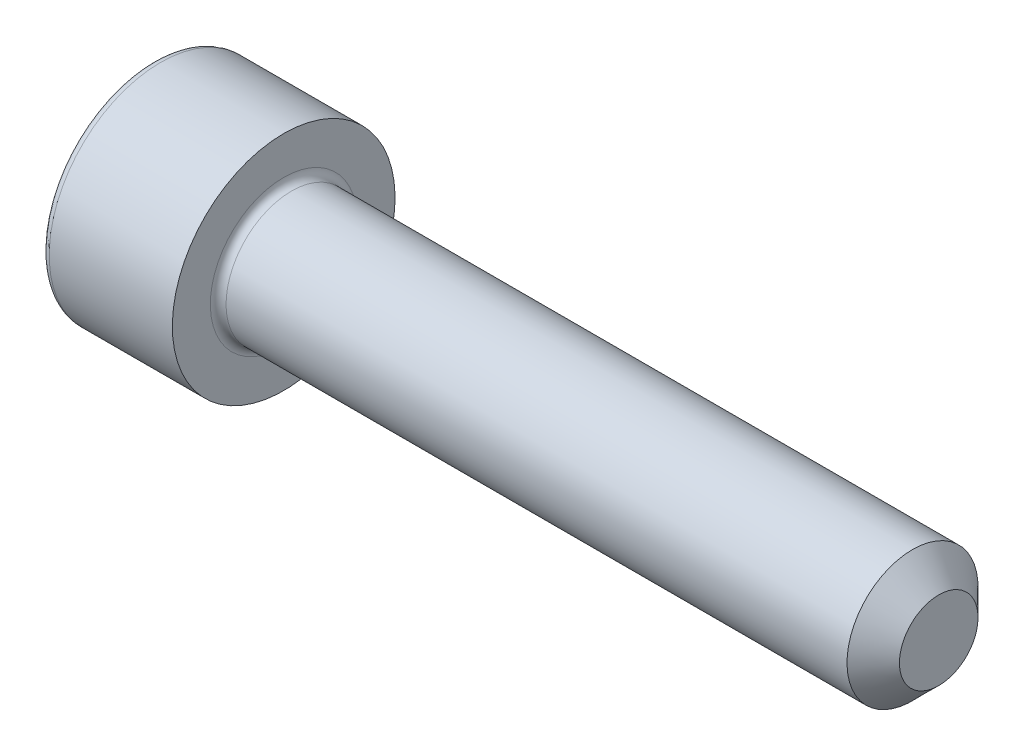
ISO-10303-21;
HEADER;
FILE_DESCRIPTION(('STEP AP214'),'2;1');
FILE_NAME('part.step','',(''),(''),'','','');
FILE_SCHEMA(('AUTOMOTIVE_DESIGN { 1 0 10303 214 1 1 1 1 }'));
ENDSEC;
DATA;
#1=APPLICATION_CONTEXT('core data for automotive mechanical design processes');
#2=APPLICATION_PROTOCOL_DEFINITION('international standard','automotive_design',2000,#1);
#3=PRODUCT_CONTEXT('',#1,'mechanical');
#4=PRODUCT('Part','Part','',(#3));
#5=PRODUCT_RELATED_PRODUCT_CATEGORY('part','',(#4));
#6=PRODUCT_DEFINITION_FORMATION('','',#4);
#7=PRODUCT_DEFINITION_CONTEXT('part definition',#1,'design');
#8=PRODUCT_DEFINITION('design','',#6,#7);
#9=PRODUCT_DEFINITION_SHAPE('','',#8);
#10=(LENGTH_UNIT() NAMED_UNIT(*) SI_UNIT(.MILLI.,.METRE.));
#11=(NAMED_UNIT(*) PLANE_ANGLE_UNIT() SI_UNIT($,.RADIAN.));
#12=(NAMED_UNIT(*) SI_UNIT($,.STERADIAN.) SOLID_ANGLE_UNIT());
#13=UNCERTAINTY_MEASURE_WITH_UNIT(LENGTH_MEASURE(1.E-05),#10,'distance_accuracy_value','');
#14=(GEOMETRIC_REPRESENTATION_CONTEXT(3) GLOBAL_UNCERTAINTY_ASSIGNED_CONTEXT((#13)) GLOBAL_UNIT_ASSIGNED_CONTEXT((#10,
#11,#12)) REPRESENTATION_CONTEXT('',''));
#15=CARTESIAN_POINT('',(0.,0.,0.));
#16=DIRECTION('',(0.,0.,1.));
#17=DIRECTION('',(1.,0.,0.));
#18=AXIS2_PLACEMENT_3D('',#15,#16,#17);
#19=CARTESIAN_POINT('',(0.,0.,0.));
#20=DIRECTION('',(-1.,0.,0.));
#21=DIRECTION('',(0.,-1.,0.));
#22=AXIS2_PLACEMENT_3D('',#19,#20,#21);
#23=PLANE('',#22);
#24=CARTESIAN_POINT('',(0.,0.,0.));
#25=DIRECTION('',(-1.,0.,0.));
#26=DIRECTION('',(0.,-1.,0.));
#27=AXIS2_PLACEMENT_3D('',#24,#25,#26);
#28=CIRCLE('',#27,3.95);
#29=CARTESIAN_POINT('',(0.,-3.95,0.));
#30=VERTEX_POINT('',#29);
#31=EDGE_CURVE('E158',#30,#30,#28,.T.);
#32=ORIENTED_EDGE('',*,*,#31,.T.);
#33=EDGE_LOOP('',(#32));
#34=FACE_BOUND('',#33,.T.);
#35=DIRECTION('',(0.,0.,-1.));
#36=VECTOR('',#35,1.);
#37=CARTESIAN_POINT('',(0.,2.,1.15470053837925));
#38=LINE('',#37,#36);
#39=CARTESIAN_POINT('',(0.,2.,1.15470053837925));
#40=VERTEX_POINT('',#39);
#41=CARTESIAN_POINT('',(0.,2.,-1.15470053837925));
#42=VERTEX_POINT('',#41);
#43=EDGE_CURVE('E54',#40,#42,#38,.T.);
#44=ORIENTED_EDGE('',*,*,#43,.F.);
#45=DIRECTION('',(0.,0.866025403784439,-0.5));
#46=VECTOR('',#45,1.);
#47=CARTESIAN_POINT('',(0.,0.,2.3094010767585));
#48=LINE('',#47,#46);
#49=CARTESIAN_POINT('',(0.,0.,2.3094010767585));
#50=VERTEX_POINT('',#49);
#51=EDGE_CURVE('E137',#50,#40,#48,.T.);
#52=ORIENTED_EDGE('',*,*,#51,.F.);
#53=DIRECTION('',(0.,0.866025403784438,0.5));
#54=VECTOR('',#53,1.);
#55=CARTESIAN_POINT('',(0.,-2.,1.15470053837925));
#56=LINE('',#55,#54);
#57=CARTESIAN_POINT('',(0.,-2.,1.15470053837925));
#58=VERTEX_POINT('',#57);
#59=EDGE_CURVE('E135',#58,#50,#56,.T.);
#60=ORIENTED_EDGE('',*,*,#59,.F.);
#61=DIRECTION('',(0.,0.,1.));
#62=VECTOR('',#61,1.);
#63=CARTESIAN_POINT('',(0.,-2.,-1.15470053837925));
#64=LINE('',#63,#62);
#65=CARTESIAN_POINT('',(0.,-2.,-1.15470053837925));
#66=VERTEX_POINT('',#65);
#67=EDGE_CURVE('E102',#66,#58,#64,.T.);
#68=ORIENTED_EDGE('',*,*,#67,.F.);
#69=DIRECTION('',(0.,-0.866025403784439,0.5));
#70=VECTOR('',#69,1.);
#71=CARTESIAN_POINT('',(0.,0.,-2.3094010767585));
#72=LINE('',#71,#70);
#73=CARTESIAN_POINT('',(0.,0.,-2.3094010767585));
#74=VERTEX_POINT('',#73);
#75=EDGE_CURVE('E131',#74,#66,#72,.T.);
#76=ORIENTED_EDGE('',*,*,#75,.F.);
#77=DIRECTION('',(0.,-0.866025403784439,-0.5));
#78=VECTOR('',#77,1.);
#79=CARTESIAN_POINT('',(0.,2.,-1.15470053837925));
#80=LINE('',#79,#78);
#81=EDGE_CURVE('E128',#42,#74,#80,.T.);
#82=ORIENTED_EDGE('',*,*,#81,.F.);
#83=EDGE_LOOP('',(#44,#52,#60,#68,#76,#82));
#84=FACE_BOUND('',#83,.T.);
#85=ADVANCED_FACE('F38',(#34,#84),#23,.T.);
#86=CARTESIAN_POINT('',(30.,0.,0.));
#87=DIRECTION('',(1.,0.,0.));
#88=DIRECTION('',(0.,1.,0.));
#89=AXIS2_PLACEMENT_3D('',#86,#87,#88);
#90=CYLINDRICAL_SURFACE('',#89,4.25);
#91=CARTESIAN_POINT('',(0.300000000000002,0.,0.));
#92=DIRECTION('',(-1.,0.,0.));
#93=DIRECTION('',(0.,-1.,0.));
#94=AXIS2_PLACEMENT_3D('',#91,#92,#93);
#95=CIRCLE('',#94,4.25);
#96=CARTESIAN_POINT('',(0.300000000000002,-4.25,0.));
#97=VERTEX_POINT('',#96);
#98=EDGE_CURVE('E155',#97,#97,#95,.F.);
#99=ORIENTED_EDGE('',*,*,#98,.T.);
#100=EDGE_LOOP('',(#99));
#101=FACE_BOUND('',#100,.T.);
#102=CARTESIAN_POINT('',(5.,0.,0.));
#103=DIRECTION('',(1.,0.,0.));
#104=DIRECTION('',(0.,1.,0.));
#105=AXIS2_PLACEMENT_3D('',#102,#103,#104);
#106=CIRCLE('',#105,4.25);
#107=CARTESIAN_POINT('',(5.,4.25,0.));
#108=VERTEX_POINT('',#107);
#109=EDGE_CURVE('E141',#108,#108,#106,.T.);
#110=ORIENTED_EDGE('',*,*,#109,.F.);
#111=EDGE_LOOP('',(#110));
#112=FACE_BOUND('',#111,.T.);
#113=ADVANCED_FACE('F175',(#101,#112),#90,.T.);
#114=CARTESIAN_POINT('',(5.,4.25,0.));
#115=DIRECTION('',(1.,0.,0.));
#116=DIRECTION('',(0.,1.,0.));
#117=AXIS2_PLACEMENT_3D('',#114,#115,#116);
#118=PLANE('',#117);
#119=CARTESIAN_POINT('',(5.,0.,0.));
#120=DIRECTION('',(1.,0.,0.));
#121=DIRECTION('',(0.,1.,0.));
#122=AXIS2_PLACEMENT_3D('',#119,#120,#121);
#123=CIRCLE('',#122,2.8);
#124=CARTESIAN_POINT('',(5.,2.8,0.));
#125=VERTEX_POINT('',#124);
#126=EDGE_CURVE('E152',#125,#125,#123,.F.);
#127=ORIENTED_EDGE('',*,*,#126,.T.);
#128=EDGE_LOOP('',(#127));
#129=FACE_BOUND('',#128,.T.);
#130=ORIENTED_EDGE('',*,*,#109,.T.);
#131=EDGE_LOOP('',(#130));
#132=FACE_BOUND('',#131,.T.);
#133=ADVANCED_FACE('F181',(#129,#132),#118,.T.);
#134=CARTESIAN_POINT('',(30.,0.,0.));
#135=DIRECTION('',(1.,0.,0.));
#136=DIRECTION('',(0.,1.,0.));
#137=AXIS2_PLACEMENT_3D('',#134,#135,#136);
#138=CYLINDRICAL_SURFACE('',#137,2.5);
#139=CARTESIAN_POINT('',(29.,0.,0.));
#140=DIRECTION('',(1.,0.,0.));
#141=DIRECTION('',(0.,1.,0.));
#142=AXIS2_PLACEMENT_3D('',#139,#140,#141);
#143=CIRCLE('',#142,2.5);
#144=CARTESIAN_POINT('',(29.,2.5,0.));
#145=VERTEX_POINT('',#144);
#146=EDGE_CURVE('E11',#145,#145,#143,.F.);
#147=ORIENTED_EDGE('',*,*,#146,.T.);
#148=EDGE_LOOP('',(#147));
#149=FACE_BOUND('',#148,.T.);
#150=CARTESIAN_POINT('',(5.3,0.,0.));
#151=DIRECTION('',(1.,0.,0.));
#152=DIRECTION('',(0.,1.,0.));
#153=AXIS2_PLACEMENT_3D('',#150,#151,#152);
#154=CIRCLE('',#153,2.5);
#155=CARTESIAN_POINT('',(5.3,2.5,0.));
#156=VERTEX_POINT('',#155);
#157=EDGE_CURVE('E149',#156,#156,#154,.T.);
#158=ORIENTED_EDGE('',*,*,#157,.T.);
#159=EDGE_LOOP('',(#158));
#160=FACE_BOUND('',#159,.T.);
#161=ADVANCED_FACE('F198',(#149,#160),#138,.T.);
#162=CARTESIAN_POINT('',(30.,2.5,0.));
#163=DIRECTION('',(1.,0.,0.));
#164=DIRECTION('',(0.,1.,0.));
#165=AXIS2_PLACEMENT_3D('',#162,#163,#164);
#166=PLANE('',#165);
#167=CARTESIAN_POINT('',(30.,0.,0.));
#168=DIRECTION('',(1.,0.,0.));
#169=DIRECTION('',(0.,1.,0.));
#170=AXIS2_PLACEMENT_3D('',#167,#168,#169);
#171=CIRCLE('',#170,1.5);
#172=CARTESIAN_POINT('',(30.,1.50000000000001,0.));
#173=VERTEX_POINT('',#172);
#174=EDGE_CURVE('E47',#173,#173,#171,.T.);
#175=ORIENTED_EDGE('',*,*,#174,.T.);
#176=EDGE_LOOP('',(#175));
#177=FACE_BOUND('',#176,.T.);
#178=ADVANCED_FACE('F163',(#177),#166,.T.);
#179=CARTESIAN_POINT('',(2.5,2.,1.15470053837925));
#180=DIRECTION('',(0.,1.,0.));
#181=DIRECTION('',(-1.,0.,0.));
#182=AXIS2_PLACEMENT_3D('',#179,#180,#181);
#183=PLANE('',#182);
#184=ORIENTED_EDGE('',*,*,#43,.T.);
#185=DIRECTION('',(-1.,0.,0.));
#186=VECTOR('',#185,1.);
#187=CARTESIAN_POINT('',(2.5,2.,-1.15470053837925));
#188=LINE('',#187,#186);
#189=CARTESIAN_POINT('',(2.5,2.,-1.15470053837925));
#190=VERTEX_POINT('',#189);
#191=EDGE_CURVE('E84',#190,#42,#188,.T.);
#192=ORIENTED_EDGE('',*,*,#191,.F.);
#193=DIRECTION('',(0.,0.,-1.));
#194=VECTOR('',#193,1.);
#195=CARTESIAN_POINT('',(2.5,2.,1.15470053837925));
#196=LINE('',#195,#194);
#197=CARTESIAN_POINT('',(2.5,2.,1.15470053837925));
#198=VERTEX_POINT('',#197);
#199=EDGE_CURVE('E139',#198,#190,#196,.T.);
#200=ORIENTED_EDGE('',*,*,#199,.F.);
#201=DIRECTION('',(-1.,0.,0.));
#202=VECTOR('',#201,1.);
#203=CARTESIAN_POINT('',(2.5,2.,1.15470053837925));
#204=LINE('',#203,#202);
#205=EDGE_CURVE('E62',#198,#40,#204,.T.);
#206=ORIENTED_EDGE('',*,*,#205,.T.);
#207=EDGE_LOOP('',(#184,#192,#200,#206));
#208=FACE_BOUND('',#207,.T.);
#209=ADVANCED_FACE('F206',(#208),#183,.F.);
#210=CARTESIAN_POINT('',(2.5,0.,2.3094010767585));
#211=DIRECTION('',(0.,0.5,0.866025403784439));
#212=DIRECTION('',(0.,-0.866025403784439,0.5));
#213=AXIS2_PLACEMENT_3D('',#210,#211,#212);
#214=PLANE('',#213);
#215=ORIENTED_EDGE('',*,*,#51,.T.);
#216=ORIENTED_EDGE('',*,*,#205,.F.);
#217=DIRECTION('',(0.,0.866025403784439,-0.5));
#218=VECTOR('',#217,1.);
#219=CARTESIAN_POINT('',(2.5,0.,2.3094010767585));
#220=LINE('',#219,#218);
#221=CARTESIAN_POINT('',(2.5,0.,2.3094010767585));
#222=VERTEX_POINT('',#221);
#223=EDGE_CURVE('E114',#222,#198,#220,.T.);
#224=ORIENTED_EDGE('',*,*,#223,.F.);
#225=DIRECTION('',(-1.,0.,0.));
#226=VECTOR('',#225,1.);
#227=CARTESIAN_POINT('',(2.5,0.,2.3094010767585));
#228=LINE('',#227,#226);
#229=EDGE_CURVE('E106',#222,#50,#228,.T.);
#230=ORIENTED_EDGE('',*,*,#229,.T.);
#231=EDGE_LOOP('',(#215,#216,#224,#230));
#232=FACE_BOUND('',#231,.T.);
#233=ADVANCED_FACE('F212',(#232),#214,.F.);
#234=CARTESIAN_POINT('',(2.5,-2.,1.15470053837925));
#235=DIRECTION('',(0.,-0.5,0.866025403784438));
#236=DIRECTION('',(0.,-0.866025403784439,-0.5));
#237=AXIS2_PLACEMENT_3D('',#234,#235,#236);
#238=PLANE('',#237);
#239=ORIENTED_EDGE('',*,*,#59,.T.);
#240=ORIENTED_EDGE('',*,*,#229,.F.);
#241=DIRECTION('',(0.,0.866025403784438,0.5));
#242=VECTOR('',#241,1.);
#243=CARTESIAN_POINT('',(2.5,-2.,1.15470053837925));
#244=LINE('',#243,#242);
#245=CARTESIAN_POINT('',(2.5,-2.,1.15470053837925));
#246=VERTEX_POINT('',#245);
#247=EDGE_CURVE('E110',#246,#222,#244,.T.);
#248=ORIENTED_EDGE('',*,*,#247,.F.);
#249=DIRECTION('',(-1.,0.,0.));
#250=VECTOR('',#249,1.);
#251=CARTESIAN_POINT('',(2.5,-2.,1.15470053837925));
#252=LINE('',#251,#250);
#253=EDGE_CURVE('E95',#246,#58,#252,.T.);
#254=ORIENTED_EDGE('',*,*,#253,.T.);
#255=EDGE_LOOP('',(#239,#240,#248,#254));
#256=FACE_BOUND('',#255,.T.);
#257=ADVANCED_FACE('F111',(#256),#238,.F.);
#258=CARTESIAN_POINT('',(2.5,-2.,-1.15470053837925));
#259=DIRECTION('',(0.,-1.,0.));
#260=DIRECTION('',(0.,0.,-1.));
#261=AXIS2_PLACEMENT_3D('',#258,#259,#260);
#262=PLANE('',#261);
#263=ORIENTED_EDGE('',*,*,#67,.T.);
#264=ORIENTED_EDGE('',*,*,#253,.F.);
#265=DIRECTION('',(0.,0.,1.));
#266=VECTOR('',#265,1.);
#267=CARTESIAN_POINT('',(2.5,-2.,-1.15470053837925));
#268=LINE('',#267,#266);
#269=CARTESIAN_POINT('',(2.5,-2.,-1.15470053837925));
#270=VERTEX_POINT('',#269);
#271=EDGE_CURVE('E99',#270,#246,#268,.T.);
#272=ORIENTED_EDGE('',*,*,#271,.F.);
#273=DIRECTION('',(-1.,0.,0.));
#274=VECTOR('',#273,1.);
#275=CARTESIAN_POINT('',(2.5,-2.,-1.15470053837925));
#276=LINE('',#275,#274);
#277=EDGE_CURVE('E107',#270,#66,#276,.T.);
#278=ORIENTED_EDGE('',*,*,#277,.T.);
#279=EDGE_LOOP('',(#263,#264,#272,#278));
#280=FACE_BOUND('',#279,.T.);
#281=ADVANCED_FACE('F97',(#280),#262,.F.);
#282=CARTESIAN_POINT('',(2.5,0.,-2.3094010767585));
#283=DIRECTION('',(0.,-0.5,-0.866025403784439));
#284=DIRECTION('',(0.,0.866025403784439,-0.5));
#285=AXIS2_PLACEMENT_3D('',#282,#283,#284);
#286=PLANE('',#285);
#287=ORIENTED_EDGE('',*,*,#75,.T.);
#288=ORIENTED_EDGE('',*,*,#277,.F.);
#289=DIRECTION('',(0.,-0.866025403784439,0.5));
#290=VECTOR('',#289,1.);
#291=CARTESIAN_POINT('',(2.5,0.,-2.3094010767585));
#292=LINE('',#291,#290);
#293=CARTESIAN_POINT('',(2.5,0.,-2.3094010767585));
#294=VERTEX_POINT('',#293);
#295=EDGE_CURVE('E120',#294,#270,#292,.T.);
#296=ORIENTED_EDGE('',*,*,#295,.F.);
#297=DIRECTION('',(-1.,0.,0.));
#298=VECTOR('',#297,1.);
#299=CARTESIAN_POINT('',(2.5,0.,-2.3094010767585));
#300=LINE('',#299,#298);
#301=EDGE_CURVE('E144',#294,#74,#300,.T.);
#302=ORIENTED_EDGE('',*,*,#301,.T.);
#303=EDGE_LOOP('',(#287,#288,#296,#302));
#304=FACE_BOUND('',#303,.T.);
#305=ADVANCED_FACE('F215',(#304),#286,.F.);
#306=CARTESIAN_POINT('',(2.5,2.,-1.15470053837925));
#307=DIRECTION('',(0.,0.5,-0.866025403784439));
#308=DIRECTION('',(0.,0.866025403784439,0.5));
#309=AXIS2_PLACEMENT_3D('',#306,#307,#308);
#310=PLANE('',#309);
#311=ORIENTED_EDGE('',*,*,#81,.T.);
#312=ORIENTED_EDGE('',*,*,#301,.F.);
#313=DIRECTION('',(0.,-0.866025403784439,-0.5));
#314=VECTOR('',#313,1.);
#315=CARTESIAN_POINT('',(2.5,2.,-1.15470053837925));
#316=LINE('',#315,#314);
#317=EDGE_CURVE('E122',#190,#294,#316,.T.);
#318=ORIENTED_EDGE('',*,*,#317,.F.);
#319=ORIENTED_EDGE('',*,*,#191,.T.);
#320=EDGE_LOOP('',(#311,#312,#318,#319));
#321=FACE_BOUND('',#320,.T.);
#322=ADVANCED_FACE('F192',(#321),#310,.F.);
#323=CARTESIAN_POINT('',(2.5,0.,0.));
#324=DIRECTION('',(-1.,0.,0.));
#325=DIRECTION('',(0.,-1.,0.));
#326=AXIS2_PLACEMENT_3D('',#323,#324,#325);
#327=PLANE('',#326);
#328=ORIENTED_EDGE('',*,*,#199,.T.);
#329=ORIENTED_EDGE('',*,*,#317,.T.);
#330=ORIENTED_EDGE('',*,*,#295,.T.);
#331=ORIENTED_EDGE('',*,*,#271,.T.);
#332=ORIENTED_EDGE('',*,*,#247,.T.);
#333=ORIENTED_EDGE('',*,*,#223,.T.);
#334=EDGE_LOOP('',(#328,#329,#330,#331,#332,#333));
#335=FACE_BOUND('',#334,.T.);
#336=ADVANCED_FACE('F117',(#335),#327,.T.);
#337=CARTESIAN_POINT('',(5.3,0.,0.));
#338=DIRECTION('',(1.,0.,0.));
#339=DIRECTION('',(0.,1.,0.));
#340=AXIS2_PLACEMENT_3D('',#337,#338,#339);
#341=TOROIDAL_SURFACE('',#340,2.8,0.3);
#342=ORIENTED_EDGE('',*,*,#126,.F.);
#343=EDGE_LOOP('',(#342));
#344=FACE_BOUND('',#343,.T.);
#345=ORIENTED_EDGE('',*,*,#157,.F.);
#346=EDGE_LOOP('',(#345));
#347=FACE_BOUND('',#346,.T.);
#348=ADVANCED_FACE('F171',(#344,#347),#341,.F.);
#349=CARTESIAN_POINT('',(0.300000000000002,0.,0.));
#350=DIRECTION('',(-1.,0.,0.));
#351=DIRECTION('',(0.,-1.,0.));
#352=AXIS2_PLACEMENT_3D('',#349,#350,#351);
#353=TOROIDAL_SURFACE('',#352,3.95,0.3);
#354=ORIENTED_EDGE('',*,*,#31,.F.);
#355=EDGE_LOOP('',(#354));
#356=FACE_BOUND('',#355,.T.);
#357=ORIENTED_EDGE('',*,*,#98,.F.);
#358=EDGE_LOOP('',(#357));
#359=FACE_BOUND('',#358,.T.);
#360=ADVANCED_FACE('F166',(#356,#359),#353,.T.);
#361=CARTESIAN_POINT('',(30.,0.,0.));
#362=DIRECTION('',(-1.,0.,0.));
#363=DIRECTION('',(0.,-1.,0.));
#364=AXIS2_PLACEMENT_3D('',#361,#362,#363);
#365=CONICAL_SURFACE('',#364,1.5,0.785398163397445);
#366=ORIENTED_EDGE('',*,*,#146,.F.);
#367=EDGE_LOOP('',(#366));
#368=FACE_BOUND('',#367,.T.);
#369=ORIENTED_EDGE('',*,*,#174,.F.);
#370=EDGE_LOOP('',(#369));
#371=FACE_BOUND('',#370,.T.);
#372=ADVANCED_FACE('F41',(#368,#371),#365,.T.);
#373=CLOSED_SHELL('',(#85,#113,#133,#161,#178,#209,#233,#257,#281,#305,#322,#336,#348,#360,#372));
#374=MANIFOLD_SOLID_BREP('B2',#373);
#375=ADVANCED_BREP_SHAPE_REPRESENTATION('',(#18,#374),#14);
#376=SHAPE_DEFINITION_REPRESENTATION(#9,#375);
ENDSEC;
END-ISO-10303-21;
